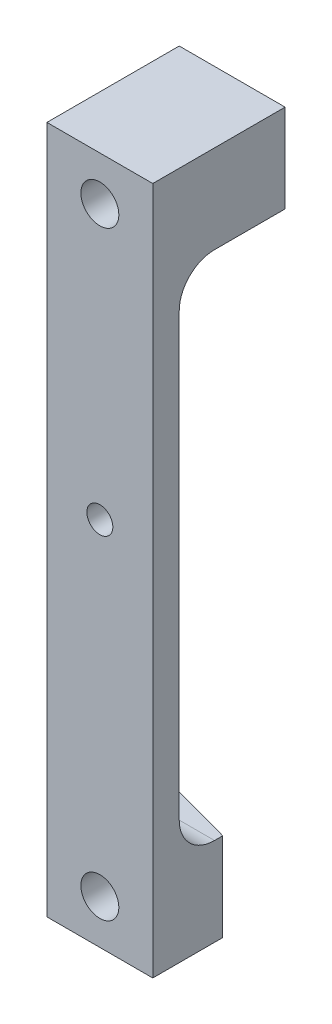
ISO-10303-21;
HEADER;
FILE_DESCRIPTION(('STEP AP214'),'2;1');
FILE_NAME('part.step','',(''),(''),'','','');
FILE_SCHEMA(('AUTOMOTIVE_DESIGN { 1 0 10303 214 1 1 1 1 }'));
ENDSEC;
DATA;
#1=APPLICATION_CONTEXT('core data for automotive mechanical design processes');
#2=APPLICATION_PROTOCOL_DEFINITION('international standard','automotive_design',2000,#1);
#3=PRODUCT_CONTEXT('',#1,'mechanical');
#4=PRODUCT('Part','Part','',(#3));
#5=PRODUCT_RELATED_PRODUCT_CATEGORY('part','',(#4));
#6=PRODUCT_DEFINITION_FORMATION('','',#4);
#7=PRODUCT_DEFINITION_CONTEXT('part definition',#1,'design');
#8=PRODUCT_DEFINITION('design','',#6,#7);
#9=PRODUCT_DEFINITION_SHAPE('','',#8);
#10=(LENGTH_UNIT() NAMED_UNIT(*) SI_UNIT(.MILLI.,.METRE.));
#11=(NAMED_UNIT(*) PLANE_ANGLE_UNIT() SI_UNIT($,.RADIAN.));
#12=(NAMED_UNIT(*) SI_UNIT($,.STERADIAN.) SOLID_ANGLE_UNIT());
#13=UNCERTAINTY_MEASURE_WITH_UNIT(LENGTH_MEASURE(1.E-05),#10,'distance_accuracy_value','');
#14=(GEOMETRIC_REPRESENTATION_CONTEXT(3) GLOBAL_UNCERTAINTY_ASSIGNED_CONTEXT((#13)) GLOBAL_UNIT_ASSIGNED_CONTEXT((#10,
#11,#12)) REPRESENTATION_CONTEXT('',''));
#15=CARTESIAN_POINT('',(0.,0.,0.));
#16=DIRECTION('',(0.,0.,1.));
#17=DIRECTION('',(1.,0.,0.));
#18=AXIS2_PLACEMENT_3D('',#15,#16,#17);
#19=CARTESIAN_POINT('',(0.,39.,0.));
#20=DIRECTION('',(0.,0.,1.));
#21=DIRECTION('',(1.,0.,0.));
#22=AXIS2_PLACEMENT_3D('',#19,#20,#21);
#23=PLANE('',#22);
#24=CARTESIAN_POINT('',(6.,3.,0.));
#25=DIRECTION('',(0.,0.,1.));
#26=DIRECTION('',(1.,0.,0.));
#27=AXIS2_PLACEMENT_3D('',#24,#25,#26);
#28=CIRCLE('',#27,1.4732);
#29=CARTESIAN_POINT('',(7.4732,3.,0.));
#30=VERTEX_POINT('',#29);
#31=EDGE_CURVE('E151',#30,#30,#28,.T.);
#32=ORIENTED_EDGE('',*,*,#31,.T.);
#33=EDGE_LOOP('',(#32));
#34=FACE_BOUND('',#33,.T.);
#35=DIRECTION('',(0.,1.,0.));
#36=VECTOR('',#35,1.);
#37=CARTESIAN_POINT('',(12.,0.,0.));
#38=LINE('',#37,#36);
#39=CARTESIAN_POINT('',(12.,-25.,0.));
#40=VERTEX_POINT('',#39);
#41=CARTESIAN_POINT('',(12.,25.,0.));
#42=VERTEX_POINT('',#41);
#43=EDGE_CURVE('E150',#40,#42,#38,.T.);
#44=ORIENTED_EDGE('',*,*,#43,.F.);
#45=DIRECTION('',(1.,0.,0.));
#46=VECTOR('',#45,1.);
#47=CARTESIAN_POINT('',(0.,-25.,0.));
#48=LINE('',#47,#46);
#49=CARTESIAN_POINT('',(0.,-25.,0.));
#50=VERTEX_POINT('',#49);
#51=EDGE_CURVE('E296',#40,#50,#48,.F.);
#52=ORIENTED_EDGE('',*,*,#51,.T.);
#53=DIRECTION('',(0.,-1.,0.));
#54=VECTOR('',#53,1.);
#55=CARTESIAN_POINT('',(0.,39.,0.));
#56=LINE('',#55,#54);
#57=CARTESIAN_POINT('',(0.,25.,0.));
#58=VERTEX_POINT('',#57);
#59=EDGE_CURVE('E146',#58,#50,#56,.T.);
#60=ORIENTED_EDGE('',*,*,#59,.F.);
#61=DIRECTION('',(-1.,0.,0.));
#62=VECTOR('',#61,1.);
#63=CARTESIAN_POINT('',(12.,25.,0.));
#64=LINE('',#63,#62);
#65=EDGE_CURVE('E145',#58,#42,#64,.F.);
#66=ORIENTED_EDGE('',*,*,#65,.T.);
#67=EDGE_LOOP('',(#44,#52,#60,#66));
#68=FACE_BOUND('',#67,.T.);
#69=ADVANCED_FACE('F26',(#34,#68),#23,.F.);
#70=CARTESIAN_POINT('',(12.,39.,3.));
#71=DIRECTION('',(0.,-1.,0.));
#72=DIRECTION('',(0.,0.,-1.));
#73=AXIS2_PLACEMENT_3D('',#70,#71,#72);
#74=PLANE('',#73);
#75=DIRECTION('',(0.,0.,-1.));
#76=VECTOR('',#75,1.);
#77=CARTESIAN_POINT('',(12.,39.,3.));
#78=LINE('',#77,#76);
#79=CARTESIAN_POINT('',(12.,39.,3.));
#80=VERTEX_POINT('',#79);
#81=CARTESIAN_POINT('',(12.,39.,-12.));
#82=VERTEX_POINT('',#81);
#83=EDGE_CURVE('E128',#80,#82,#78,.T.);
#84=ORIENTED_EDGE('',*,*,#83,.T.);
#85=DIRECTION('',(1.,0.,0.));
#86=VECTOR('',#85,1.);
#87=CARTESIAN_POINT('',(0.,39.,-12.));
#88=LINE('',#87,#86);
#89=CARTESIAN_POINT('',(0.,39.,-12.));
#90=VERTEX_POINT('',#89);
#91=EDGE_CURVE('E172',#90,#82,#88,.T.);
#92=ORIENTED_EDGE('',*,*,#91,.F.);
#93=DIRECTION('',(0.,0.,-1.));
#94=VECTOR('',#93,1.);
#95=CARTESIAN_POINT('',(0.,39.,3.));
#96=LINE('',#95,#94);
#97=CARTESIAN_POINT('',(0.,39.,3.));
#98=VERTEX_POINT('',#97);
#99=EDGE_CURVE('E123',#98,#90,#96,.T.);
#100=ORIENTED_EDGE('',*,*,#99,.F.);
#101=DIRECTION('',(-1.,0.,0.));
#102=VECTOR('',#101,1.);
#103=CARTESIAN_POINT('',(12.,39.,3.));
#104=LINE('',#103,#102);
#105=EDGE_CURVE('E159',#80,#98,#104,.T.);
#106=ORIENTED_EDGE('',*,*,#105,.F.);
#107=EDGE_LOOP('',(#84,#92,#100,#106));
#108=FACE_BOUND('',#107,.T.);
#109=ADVANCED_FACE('F28',(#108),#74,.F.);
#110=CARTESIAN_POINT('',(0.,39.,3.));
#111=DIRECTION('',(1.,0.,0.));
#112=DIRECTION('',(0.,0.,-1.));
#113=AXIS2_PLACEMENT_3D('',#110,#111,#112);
#114=PLANE('',#113);
#115=DIRECTION('',(0.,0.,1.));
#116=VECTOR('',#115,1.);
#117=CARTESIAN_POINT('',(0.,-29.,-12.));
#118=LINE('',#117,#116);
#119=CARTESIAN_POINT('',(0.,-29.,-8.192));
#120=VERTEX_POINT('',#119);
#121=CARTESIAN_POINT('',(0.,-29.,-4.));
#122=VERTEX_POINT('',#121);
#123=EDGE_CURVE('E119',#120,#122,#118,.T.);
#124=ORIENTED_EDGE('',*,*,#123,.F.);
#125=DIRECTION('',(0.,1.,0.));
#126=VECTOR('',#125,1.);
#127=CARTESIAN_POINT('',(0.,-52.9269974676532,-8.192));
#128=LINE('',#127,#126);
#129=CARTESIAN_POINT('',(0.,-39.,-8.192));
#130=VERTEX_POINT('',#129);
#131=EDGE_CURVE('E42',#130,#120,#128,.T.);
#132=ORIENTED_EDGE('',*,*,#131,.F.);
#133=DIRECTION('',(0.,0.,-1.));
#134=VECTOR('',#133,1.);
#135=CARTESIAN_POINT('',(0.,-39.,3.));
#136=LINE('',#135,#134);
#137=CARTESIAN_POINT('',(0.,-39.,3.));
#138=VERTEX_POINT('',#137);
#139=EDGE_CURVE('E116',#138,#130,#136,.T.);
#140=ORIENTED_EDGE('',*,*,#139,.F.);
#141=DIRECTION('',(0.,-1.,0.));
#142=VECTOR('',#141,1.);
#143=CARTESIAN_POINT('',(0.,39.,3.));
#144=LINE('',#143,#142);
#145=EDGE_CURVE('E162',#98,#138,#144,.T.);
#146=ORIENTED_EDGE('',*,*,#145,.F.);
#147=ORIENTED_EDGE('',*,*,#99,.T.);
#148=DIRECTION('',(0.,1.,0.));
#149=VECTOR('',#148,1.);
#150=CARTESIAN_POINT('',(0.,39.,-12.));
#151=LINE('',#150,#149);
#152=CARTESIAN_POINT('',(0.,29.,-12.));
#153=VERTEX_POINT('',#152);
#154=EDGE_CURVE('E180',#153,#90,#151,.T.);
#155=ORIENTED_EDGE('',*,*,#154,.F.);
#156=DIRECTION('',(0.,0.,1.));
#157=VECTOR('',#156,1.);
#158=CARTESIAN_POINT('',(0.,29.,-12.));
#159=LINE('',#158,#157);
#160=CARTESIAN_POINT('',(0.,29.,-4.));
#161=VERTEX_POINT('',#160);
#162=EDGE_CURVE('E132',#153,#161,#159,.T.);
#163=ORIENTED_EDGE('',*,*,#162,.T.);
#164=CARTESIAN_POINT('',(0.,25.,-4.));
#165=DIRECTION('',(1.,0.,0.));
#166=DIRECTION('',(0.,0.,-1.));
#167=AXIS2_PLACEMENT_3D('',#164,#165,#166);
#168=CIRCLE('',#167,4.);
#169=EDGE_CURVE('E297',#161,#58,#168,.T.);
#170=ORIENTED_EDGE('',*,*,#169,.T.);
#171=ORIENTED_EDGE('',*,*,#59,.T.);
#172=CARTESIAN_POINT('',(0.,-25.,-4.));
#173=DIRECTION('',(1.,0.,0.));
#174=DIRECTION('',(0.,0.,-1.));
#175=AXIS2_PLACEMENT_3D('',#172,#173,#174);
#176=CIRCLE('',#175,4.);
#177=EDGE_CURVE('E294',#50,#122,#176,.T.);
#178=ORIENTED_EDGE('',*,*,#177,.T.);
#179=EDGE_LOOP('',(#124,#132,#140,#146,#147,#155,#163,#170,#171,#178));
#180=FACE_BOUND('',#179,.T.);
#181=ADVANCED_FACE('F115',(#180),#114,.F.);
#182=CARTESIAN_POINT('',(0.,-39.,3.));
#183=DIRECTION('',(0.,1.,0.));
#184=DIRECTION('',(0.,0.,1.));
#185=AXIS2_PLACEMENT_3D('',#182,#183,#184);
#186=PLANE('',#185);
#187=ORIENTED_EDGE('',*,*,#139,.T.);
#188=DIRECTION('',(-0.965016494472311,0.,-0.262189178640865));
#189=VECTOR('',#188,1.);
#190=CARTESIAN_POINT('',(0.,-39.,-8.192));
#191=LINE('',#190,#189);
#192=CARTESIAN_POINT('',(12.,-39.,-4.93167215927141));
#193=VERTEX_POINT('',#192);
#194=EDGE_CURVE('E102',#193,#130,#191,.T.);
#195=ORIENTED_EDGE('',*,*,#194,.F.);
#196=DIRECTION('',(0.,0.,-1.));
#197=VECTOR('',#196,1.);
#198=CARTESIAN_POINT('',(12.,-39.,3.));
#199=LINE('',#198,#197);
#200=CARTESIAN_POINT('',(12.,-39.,3.));
#201=VERTEX_POINT('',#200);
#202=EDGE_CURVE('E124',#201,#193,#199,.T.);
#203=ORIENTED_EDGE('',*,*,#202,.F.);
#204=DIRECTION('',(1.,0.,0.));
#205=VECTOR('',#204,1.);
#206=CARTESIAN_POINT('',(0.,-39.,3.));
#207=LINE('',#206,#205);
#208=EDGE_CURVE('E122',#138,#201,#207,.T.);
#209=ORIENTED_EDGE('',*,*,#208,.F.);
#210=EDGE_LOOP('',(#187,#195,#203,#209));
#211=FACE_BOUND('',#210,.T.);
#212=ADVANCED_FACE('F121',(#211),#186,.F.);
#213=CARTESIAN_POINT('',(12.,0.,3.));
#214=DIRECTION('',(-1.,0.,0.));
#215=DIRECTION('',(0.,0.,1.));
#216=AXIS2_PLACEMENT_3D('',#213,#214,#215);
#217=PLANE('',#216);
#218=ORIENTED_EDGE('',*,*,#202,.T.);
#219=DIRECTION('',(0.,1.,0.));
#220=VECTOR('',#219,1.);
#221=CARTESIAN_POINT('',(12.,-52.9269974676532,-4.93167215927141));
#222=LINE('',#221,#220);
#223=CARTESIAN_POINT('',(12.,-29.,-4.93167215927141));
#224=VERTEX_POINT('',#223);
#225=EDGE_CURVE('E105',#193,#224,#222,.T.);
#226=ORIENTED_EDGE('',*,*,#225,.T.);
#227=DIRECTION('',(0.,0.,1.));
#228=VECTOR('',#227,1.);
#229=CARTESIAN_POINT('',(12.,-29.,-12.));
#230=LINE('',#229,#228);
#231=CARTESIAN_POINT('',(12.,-29.,-4.));
#232=VERTEX_POINT('',#231);
#233=EDGE_CURVE('E110',#224,#232,#230,.T.);
#234=ORIENTED_EDGE('',*,*,#233,.T.);
#235=CARTESIAN_POINT('',(12.,-25.,-4.));
#236=DIRECTION('',(-1.,0.,0.));
#237=DIRECTION('',(0.,0.,1.));
#238=AXIS2_PLACEMENT_3D('',#235,#236,#237);
#239=CIRCLE('',#238,4.);
#240=EDGE_CURVE('E298',#232,#40,#239,.T.);
#241=ORIENTED_EDGE('',*,*,#240,.T.);
#242=ORIENTED_EDGE('',*,*,#43,.T.);
#243=CARTESIAN_POINT('',(12.,25.,-4.));
#244=DIRECTION('',(-1.,0.,0.));
#245=DIRECTION('',(0.,0.,1.));
#246=AXIS2_PLACEMENT_3D('',#243,#244,#245);
#247=CIRCLE('',#246,4.);
#248=CARTESIAN_POINT('',(12.,29.,-4.));
#249=VERTEX_POINT('',#248);
#250=EDGE_CURVE('E35',#42,#249,#247,.T.);
#251=ORIENTED_EDGE('',*,*,#250,.T.);
#252=DIRECTION('',(0.,0.,1.));
#253=VECTOR('',#252,1.);
#254=CARTESIAN_POINT('',(12.,29.,-12.));
#255=LINE('',#254,#253);
#256=CARTESIAN_POINT('',(12.,29.,-12.));
#257=VERTEX_POINT('',#256);
#258=EDGE_CURVE('E135',#257,#249,#255,.T.);
#259=ORIENTED_EDGE('',*,*,#258,.F.);
#260=DIRECTION('',(0.,-1.,0.));
#261=VECTOR('',#260,1.);
#262=CARTESIAN_POINT('',(12.,39.,-12.));
#263=LINE('',#262,#261);
#264=EDGE_CURVE('E178',#82,#257,#263,.T.);
#265=ORIENTED_EDGE('',*,*,#264,.F.);
#266=ORIENTED_EDGE('',*,*,#83,.F.);
#267=DIRECTION('',(0.,1.,0.));
#268=VECTOR('',#267,1.);
#269=CARTESIAN_POINT('',(12.,-39.,3.));
#270=LINE('',#269,#268);
#271=EDGE_CURVE('E165',#201,#80,#270,.T.);
#272=ORIENTED_EDGE('',*,*,#271,.F.);
#273=EDGE_LOOP('',(#218,#226,#234,#241,#242,#251,#259,#265,#266,#272));
#274=FACE_BOUND('',#273,.T.);
#275=ADVANCED_FACE('F182',(#274),#217,.F.);
#276=CARTESIAN_POINT('',(0.,39.,3.));
#277=DIRECTION('',(0.,0.,1.));
#278=DIRECTION('',(1.,0.,0.));
#279=AXIS2_PLACEMENT_3D('',#276,#277,#278);
#280=PLANE('',#279);
#281=CARTESIAN_POINT('',(6.,34.,3.));
#282=DIRECTION('',(0.,0.,1.));
#283=DIRECTION('',(1.,0.,0.));
#284=AXIS2_PLACEMENT_3D('',#281,#282,#283);
#285=CIRCLE('',#284,2.15264999999999);
#286=CARTESIAN_POINT('',(8.15264999999999,34.,3.));
#287=VERTEX_POINT('',#286);
#288=EDGE_CURVE('E319',#287,#287,#285,.T.);
#289=ORIENTED_EDGE('',*,*,#288,.F.);
#290=EDGE_LOOP('',(#289));
#291=FACE_BOUND('',#290,.T.);
#292=CARTESIAN_POINT('',(6.,-34.,3.));
#293=DIRECTION('',(0.,0.,1.));
#294=DIRECTION('',(1.,0.,0.));
#295=AXIS2_PLACEMENT_3D('',#292,#293,#294);
#296=CIRCLE('',#295,2.15264999999999);
#297=CARTESIAN_POINT('',(8.15264999999999,-34.,3.));
#298=VERTEX_POINT('',#297);
#299=EDGE_CURVE('E316',#298,#298,#296,.T.);
#300=ORIENTED_EDGE('',*,*,#299,.F.);
#301=EDGE_LOOP('',(#300));
#302=FACE_BOUND('',#301,.T.);
#303=CARTESIAN_POINT('',(6.,3.,3.));
#304=DIRECTION('',(0.,0.,1.));
#305=DIRECTION('',(1.,0.,0.));
#306=AXIS2_PLACEMENT_3D('',#303,#304,#305);
#307=CIRCLE('',#306,1.4732);
#308=CARTESIAN_POINT('',(7.4732,3.,3.));
#309=VERTEX_POINT('',#308);
#310=EDGE_CURVE('E140',#309,#309,#307,.T.);
#311=ORIENTED_EDGE('',*,*,#310,.F.);
#312=EDGE_LOOP('',(#311));
#313=FACE_BOUND('',#312,.T.);
#314=ORIENTED_EDGE('',*,*,#105,.T.);
#315=ORIENTED_EDGE('',*,*,#145,.T.);
#316=ORIENTED_EDGE('',*,*,#208,.T.);
#317=ORIENTED_EDGE('',*,*,#271,.T.);
#318=EDGE_LOOP('',(#314,#315,#316,#317));
#319=FACE_BOUND('',#318,.T.);
#320=ADVANCED_FACE('F198',(#291,#302,#313,#319),#280,.T.);
#321=CARTESIAN_POINT('',(6.,3.,0.));
#322=DIRECTION('',(0.,0.,1.));
#323=DIRECTION('',(1.,0.,0.));
#324=AXIS2_PLACEMENT_3D('',#321,#322,#323);
#325=CYLINDRICAL_SURFACE('',#324,1.4732);
#326=ORIENTED_EDGE('',*,*,#31,.F.);
#327=EDGE_LOOP('',(#326));
#328=FACE_BOUND('',#327,.T.);
#329=ORIENTED_EDGE('',*,*,#310,.T.);
#330=EDGE_LOOP('',(#329));
#331=FACE_BOUND('',#330,.T.);
#332=ADVANCED_FACE('F195',(#328,#331),#325,.F.);
#333=CARTESIAN_POINT('',(0.,29.,-12.));
#334=DIRECTION('',(0.,1.,0.));
#335=DIRECTION('',(-1.,0.,0.));
#336=AXIS2_PLACEMENT_3D('',#333,#334,#335);
#337=PLANE('',#336);
#338=ORIENTED_EDGE('',*,*,#258,.T.);
#339=DIRECTION('',(-1.,0.,0.));
#340=VECTOR('',#339,1.);
#341=CARTESIAN_POINT('',(0.,29.,-4.));
#342=LINE('',#341,#340);
#343=EDGE_CURVE('E301',#249,#161,#342,.T.);
#344=ORIENTED_EDGE('',*,*,#343,.T.);
#345=ORIENTED_EDGE('',*,*,#162,.F.);
#346=DIRECTION('',(-1.,0.,0.));
#347=VECTOR('',#346,1.);
#348=CARTESIAN_POINT('',(0.,29.,-12.));
#349=LINE('',#348,#347);
#350=EDGE_CURVE('E136',#257,#153,#349,.T.);
#351=ORIENTED_EDGE('',*,*,#350,.F.);
#352=EDGE_LOOP('',(#338,#344,#345,#351));
#353=FACE_BOUND('',#352,.T.);
#354=ADVANCED_FACE('F197',(#353),#337,.F.);
#355=CARTESIAN_POINT('',(0.,39.,-12.));
#356=DIRECTION('',(0.,0.,1.));
#357=DIRECTION('',(1.,0.,0.));
#358=AXIS2_PLACEMENT_3D('',#355,#356,#357);
#359=PLANE('',#358);
#360=CARTESIAN_POINT('',(6.,34.,-12.));
#361=DIRECTION('',(0.,0.,1.));
#362=DIRECTION('',(1.,0.,0.));
#363=AXIS2_PLACEMENT_3D('',#360,#361,#362);
#364=CIRCLE('',#363,2.15265);
#365=CARTESIAN_POINT('',(8.15265,34.,-12.));
#366=VERTEX_POINT('',#365);
#367=EDGE_CURVE('E322',#366,#366,#364,.T.);
#368=ORIENTED_EDGE('',*,*,#367,.T.);
#369=EDGE_LOOP('',(#368));
#370=FACE_BOUND('',#369,.T.);
#371=ORIENTED_EDGE('',*,*,#154,.T.);
#372=ORIENTED_EDGE('',*,*,#91,.T.);
#373=ORIENTED_EDGE('',*,*,#264,.T.);
#374=ORIENTED_EDGE('',*,*,#350,.T.);
#375=EDGE_LOOP('',(#371,#372,#373,#374));
#376=FACE_BOUND('',#375,.T.);
#377=ADVANCED_FACE('F177',(#370,#376),#359,.F.);
#378=CARTESIAN_POINT('',(0.,-29.,-12.));
#379=DIRECTION('',(0.,-1.,0.));
#380=DIRECTION('',(0.,0.,-1.));
#381=AXIS2_PLACEMENT_3D('',#378,#379,#380);
#382=PLANE('',#381);
#383=ORIENTED_EDGE('',*,*,#233,.F.);
#384=DIRECTION('',(-0.965016494472311,0.,-0.262189178640865));
#385=VECTOR('',#384,1.);
#386=CARTESIAN_POINT('',(-0.963488286886697,-29.,-8.45377397382939));
#387=LINE('',#386,#385);
#388=EDGE_CURVE('E11',#224,#120,#387,.T.);
#389=ORIENTED_EDGE('',*,*,#388,.T.);
#390=ORIENTED_EDGE('',*,*,#123,.T.);
#391=DIRECTION('',(1.,0.,0.));
#392=VECTOR('',#391,1.);
#393=CARTESIAN_POINT('',(12.,-29.,-4.));
#394=LINE('',#393,#392);
#395=EDGE_CURVE('E126',#122,#232,#394,.T.);
#396=ORIENTED_EDGE('',*,*,#395,.T.);
#397=EDGE_LOOP('',(#383,#389,#390,#396));
#398=FACE_BOUND('',#397,.T.);
#399=ADVANCED_FACE('F240',(#398),#382,.F.);
#400=CARTESIAN_POINT('',(0.,-25.,-4.));
#401=DIRECTION('',(-1.,0.,0.));
#402=DIRECTION('',(0.,0.,1.));
#403=AXIS2_PLACEMENT_3D('',#400,#401,#402);
#404=CYLINDRICAL_SURFACE('',#403,4.);
#405=ORIENTED_EDGE('',*,*,#177,.F.);
#406=ORIENTED_EDGE('',*,*,#51,.F.);
#407=ORIENTED_EDGE('',*,*,#240,.F.);
#408=ORIENTED_EDGE('',*,*,#395,.F.);
#409=EDGE_LOOP('',(#405,#406,#407,#408));
#410=FACE_BOUND('',#409,.T.);
#411=ADVANCED_FACE('F243',(#410),#404,.F.);
#412=CARTESIAN_POINT('',(0.,25.,-4.));
#413=DIRECTION('',(1.,0.,0.));
#414=DIRECTION('',(0.,1.,0.));
#415=AXIS2_PLACEMENT_3D('',#412,#413,#414);
#416=CYLINDRICAL_SURFACE('',#415,4.);
#417=ORIENTED_EDGE('',*,*,#250,.F.);
#418=ORIENTED_EDGE('',*,*,#65,.F.);
#419=ORIENTED_EDGE('',*,*,#169,.F.);
#420=ORIENTED_EDGE('',*,*,#343,.F.);
#421=EDGE_LOOP('',(#417,#418,#419,#420));
#422=FACE_BOUND('',#421,.T.);
#423=ADVANCED_FACE('F225',(#422),#416,.F.);
#424=CARTESIAN_POINT('',(0.,-52.9269974676532,-8.192));
#425=DIRECTION('',(-0.262189178640865,0.,0.965016494472311));
#426=DIRECTION('',(0.965016494472311,0.,0.262189178640865));
#427=AXIS2_PLACEMENT_3D('',#424,#425,#426);
#428=PLANE('',#427);
#429=CARTESIAN_POINT('',(6.,-34.,-6.56183607963571));
#430=DIRECTION('',(-0.262189178640865,0.,0.965016494472311));
#431=DIRECTION('',(0.965016494472311,0.,0.262189178640865));
#432=AXIS2_PLACEMENT_3D('',#429,#430,#431);
#433=ELLIPSE('',#432,2.23068726009404,2.15264999999999);
#434=CARTESIAN_POINT('',(8.15265,-34.,-5.97697401910701));
#435=VERTEX_POINT('',#434);
#436=EDGE_CURVE('E30',#435,#435,#433,.T.);
#437=ORIENTED_EDGE('',*,*,#436,.T.);
#438=EDGE_LOOP('',(#437));
#439=FACE_BOUND('',#438,.T.);
#440=ORIENTED_EDGE('',*,*,#225,.F.);
#441=ORIENTED_EDGE('',*,*,#194,.T.);
#442=ORIENTED_EDGE('',*,*,#131,.T.);
#443=ORIENTED_EDGE('',*,*,#388,.F.);
#444=EDGE_LOOP('',(#440,#441,#442,#443));
#445=FACE_BOUND('',#444,.T.);
#446=ADVANCED_FACE('F103',(#439,#445),#428,.F.);
#447=CARTESIAN_POINT('',(6.,-34.,3.));
#448=DIRECTION('',(0.,0.,1.));
#449=DIRECTION('',(1.,0.,0.));
#450=AXIS2_PLACEMENT_3D('',#447,#448,#449);
#451=CYLINDRICAL_SURFACE('',#450,2.15264999999999);
#452=ORIENTED_EDGE('',*,*,#299,.T.);
#453=EDGE_LOOP('',(#452));
#454=FACE_BOUND('',#453,.T.);
#455=ORIENTED_EDGE('',*,*,#436,.F.);
#456=EDGE_LOOP('',(#455));
#457=FACE_BOUND('',#456,.T.);
#458=ADVANCED_FACE('F265',(#454,#457),#451,.F.);
#459=CARTESIAN_POINT('',(6.,34.,3.));
#460=DIRECTION('',(0.,0.,1.));
#461=DIRECTION('',(1.,0.,0.));
#462=AXIS2_PLACEMENT_3D('',#459,#460,#461);
#463=CYLINDRICAL_SURFACE('',#462,2.15264999999999);
#464=ORIENTED_EDGE('',*,*,#367,.F.);
#465=EDGE_LOOP('',(#464));
#466=FACE_BOUND('',#465,.T.);
#467=ORIENTED_EDGE('',*,*,#288,.T.);
#468=EDGE_LOOP('',(#467));
#469=FACE_BOUND('',#468,.T.);
#470=ADVANCED_FACE('F273',(#466,#469),#463,.F.);
#471=CLOSED_SHELL('',(#69,#109,#181,#212,#275,#320,#332,#354,#377,#399,#411,#423,#446,#458,#470));
#472=MANIFOLD_SOLID_BREP('B2',#471);
#473=ADVANCED_BREP_SHAPE_REPRESENTATION('',(#18,#472),#14);
#474=SHAPE_DEFINITION_REPRESENTATION(#9,#473);
ENDSEC;
END-ISO-10303-21;
